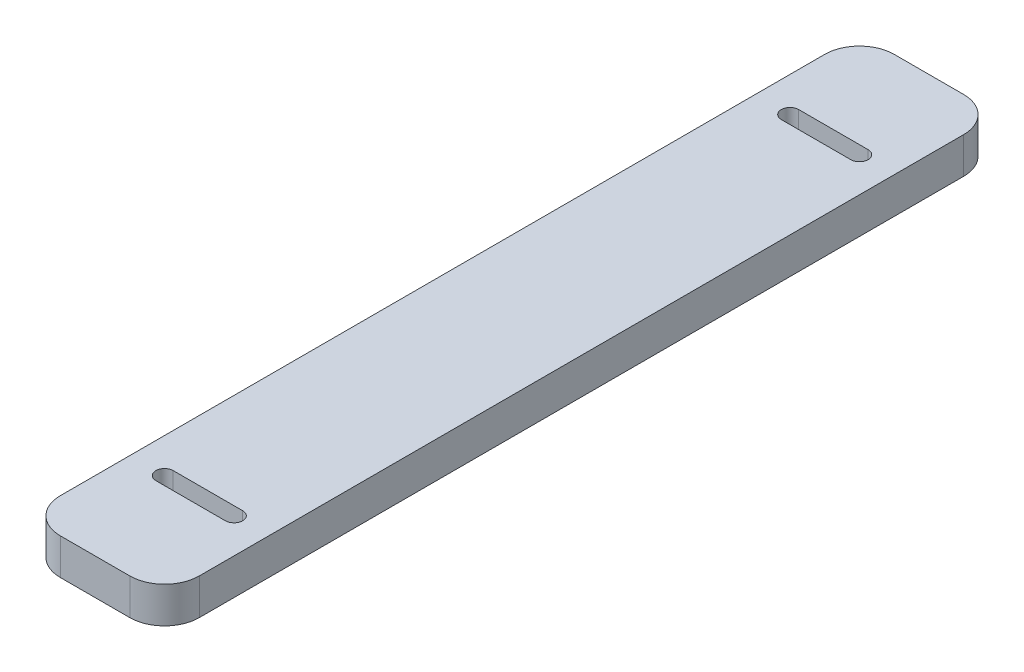
ISO-10303-21;
HEADER;
FILE_DESCRIPTION(('STEP AP214'),'2;1');
FILE_NAME('part.step','',(''),(''),'','','');
FILE_SCHEMA(('AUTOMOTIVE_DESIGN { 1 0 10303 214 1 1 1 1 }'));
ENDSEC;
DATA;
#1=APPLICATION_CONTEXT('core data for automotive mechanical design processes');
#2=APPLICATION_PROTOCOL_DEFINITION('international standard','automotive_design',2000,#1);
#3=PRODUCT_CONTEXT('',#1,'mechanical');
#4=PRODUCT('Part','Part','',(#3));
#5=PRODUCT_RELATED_PRODUCT_CATEGORY('part','',(#4));
#6=PRODUCT_DEFINITION_FORMATION('','',#4);
#7=PRODUCT_DEFINITION_CONTEXT('part definition',#1,'design');
#8=PRODUCT_DEFINITION('design','',#6,#7);
#9=PRODUCT_DEFINITION_SHAPE('','',#8);
#10=(LENGTH_UNIT() NAMED_UNIT(*) SI_UNIT(.MILLI.,.METRE.));
#11=(NAMED_UNIT(*) PLANE_ANGLE_UNIT() SI_UNIT($,.RADIAN.));
#12=(NAMED_UNIT(*) SI_UNIT($,.STERADIAN.) SOLID_ANGLE_UNIT());
#13=UNCERTAINTY_MEASURE_WITH_UNIT(LENGTH_MEASURE(1.E-05),#10,'distance_accuracy_value','');
#14=(GEOMETRIC_REPRESENTATION_CONTEXT(3) GLOBAL_UNCERTAINTY_ASSIGNED_CONTEXT((#13)) GLOBAL_UNIT_ASSIGNED_CONTEXT((#10,
#11,#12)) REPRESENTATION_CONTEXT('',''));
#15=CARTESIAN_POINT('',(0.,0.,0.));
#16=DIRECTION('',(0.,0.,1.));
#17=DIRECTION('',(1.,0.,0.));
#18=AXIS2_PLACEMENT_3D('',#15,#16,#17);
#19=CARTESIAN_POINT('',(-12.7,6.604,-76.2));
#20=DIRECTION('',(1.,0.,0.));
#21=DIRECTION('',(0.,0.,-1.));
#22=AXIS2_PLACEMENT_3D('',#19,#20,#21);
#23=PLANE('',#22);
#24=DIRECTION('',(0.,0.,1.));
#25=VECTOR('',#24,1.);
#26=CARTESIAN_POINT('',(-12.7,0.,-76.2));
#27=LINE('',#26,#25);
#28=CARTESIAN_POINT('',(-12.7,0.,-69.85));
#29=VERTEX_POINT('',#28);
#30=CARTESIAN_POINT('',(-12.7,0.,69.85));
#31=VERTEX_POINT('',#30);
#32=EDGE_CURVE('E217',#29,#31,#27,.T.);
#33=ORIENTED_EDGE('',*,*,#32,.T.);
#34=DIRECTION('',(0.,-1.,0.));
#35=VECTOR('',#34,1.);
#36=CARTESIAN_POINT('',(-12.7,6.604,69.85));
#37=LINE('',#36,#35);
#38=CARTESIAN_POINT('',(-12.7,6.604,69.85));
#39=VERTEX_POINT('',#38);
#40=EDGE_CURVE('E260',#31,#39,#37,.F.);
#41=ORIENTED_EDGE('',*,*,#40,.T.);
#42=DIRECTION('',(0.,0.,1.));
#43=VECTOR('',#42,1.);
#44=CARTESIAN_POINT('',(-12.7,6.604,-76.2));
#45=LINE('',#44,#43);
#46=CARTESIAN_POINT('',(-12.7,6.604,-69.85));
#47=VERTEX_POINT('',#46);
#48=EDGE_CURVE('E224',#47,#39,#45,.T.);
#49=ORIENTED_EDGE('',*,*,#48,.F.);
#50=DIRECTION('',(0.,-1.,0.));
#51=VECTOR('',#50,1.);
#52=CARTESIAN_POINT('',(-12.7,6.604,-69.85));
#53=LINE('',#52,#51);
#54=EDGE_CURVE('E257',#47,#29,#53,.T.);
#55=ORIENTED_EDGE('',*,*,#54,.T.);
#56=EDGE_LOOP('',(#33,#41,#49,#55));
#57=FACE_BOUND('',#56,.T.);
#58=ADVANCED_FACE('F35',(#57),#23,.F.);
#59=CARTESIAN_POINT('',(-12.7,6.604,76.2));
#60=DIRECTION('',(0.,0.,-1.));
#61=DIRECTION('',(-1.,0.,0.));
#62=AXIS2_PLACEMENT_3D('',#59,#60,#61);
#63=PLANE('',#62);
#64=DIRECTION('',(1.,0.,0.));
#65=VECTOR('',#64,1.);
#66=CARTESIAN_POINT('',(-12.7,6.604,76.2));
#67=LINE('',#66,#65);
#68=CARTESIAN_POINT('',(-6.34999999999999,6.604,76.2));
#69=VERTEX_POINT('',#68);
#70=CARTESIAN_POINT('',(6.35000000000001,6.604,76.2));
#71=VERTEX_POINT('',#70);
#72=EDGE_CURVE('E227',#69,#71,#67,.T.);
#73=ORIENTED_EDGE('',*,*,#72,.F.);
#74=DIRECTION('',(0.,-1.,0.));
#75=VECTOR('',#74,1.);
#76=CARTESIAN_POINT('',(-6.34999999999999,6.604,76.2));
#77=LINE('',#76,#75);
#78=CARTESIAN_POINT('',(-6.34999999999999,0.,76.2));
#79=VERTEX_POINT('',#78);
#80=EDGE_CURVE('E246',#69,#79,#77,.T.);
#81=ORIENTED_EDGE('',*,*,#80,.T.);
#82=DIRECTION('',(1.,0.,0.));
#83=VECTOR('',#82,1.);
#84=CARTESIAN_POINT('',(-12.7,0.,76.2));
#85=LINE('',#84,#83);
#86=CARTESIAN_POINT('',(6.35000000000001,0.,76.2));
#87=VERTEX_POINT('',#86);
#88=EDGE_CURVE('E238',#79,#87,#85,.T.);
#89=ORIENTED_EDGE('',*,*,#88,.T.);
#90=DIRECTION('',(0.,-1.,0.));
#91=VECTOR('',#90,1.);
#92=CARTESIAN_POINT('',(6.35000000000001,6.604,76.2));
#93=LINE('',#92,#91);
#94=EDGE_CURVE('E235',#87,#71,#93,.F.);
#95=ORIENTED_EDGE('',*,*,#94,.T.);
#96=EDGE_LOOP('',(#73,#81,#89,#95));
#97=FACE_BOUND('',#96,.T.);
#98=ADVANCED_FACE('F296',(#97),#63,.F.);
#99=CARTESIAN_POINT('',(12.7,6.604,-76.2));
#100=DIRECTION('',(-1.,0.,0.));
#101=DIRECTION('',(0.,0.,1.));
#102=AXIS2_PLACEMENT_3D('',#99,#100,#101);
#103=PLANE('',#102);
#104=DIRECTION('',(0.,0.,-1.));
#105=VECTOR('',#104,1.);
#106=CARTESIAN_POINT('',(12.7,6.604,-76.2));
#107=LINE('',#106,#105);
#108=CARTESIAN_POINT('',(12.7,6.604,69.85));
#109=VERTEX_POINT('',#108);
#110=CARTESIAN_POINT('',(12.7,6.604,-69.85));
#111=VERTEX_POINT('',#110);
#112=EDGE_CURVE('E231',#109,#111,#107,.T.);
#113=ORIENTED_EDGE('',*,*,#112,.F.);
#114=DIRECTION('',(0.,-1.,0.));
#115=VECTOR('',#114,1.);
#116=CARTESIAN_POINT('',(12.7,6.604,69.85));
#117=LINE('',#116,#115);
#118=CARTESIAN_POINT('',(12.7,0.,69.85));
#119=VERTEX_POINT('',#118);
#120=EDGE_CURVE('E271',#109,#119,#117,.T.);
#121=ORIENTED_EDGE('',*,*,#120,.T.);
#122=DIRECTION('',(0.,0.,-1.));
#123=VECTOR('',#122,1.);
#124=CARTESIAN_POINT('',(12.7,0.,-76.2));
#125=LINE('',#124,#123);
#126=CARTESIAN_POINT('',(12.7,0.,-69.85));
#127=VERTEX_POINT('',#126);
#128=EDGE_CURVE('E241',#119,#127,#125,.T.);
#129=ORIENTED_EDGE('',*,*,#128,.T.);
#130=DIRECTION('',(0.,-1.,0.));
#131=VECTOR('',#130,1.);
#132=CARTESIAN_POINT('',(12.7,6.604,-69.85));
#133=LINE('',#132,#131);
#134=EDGE_CURVE('E269',#127,#111,#133,.F.);
#135=ORIENTED_EDGE('',*,*,#134,.T.);
#136=EDGE_LOOP('',(#113,#121,#129,#135));
#137=FACE_BOUND('',#136,.T.);
#138=ADVANCED_FACE('F304',(#137),#103,.F.);
#139=CARTESIAN_POINT('',(-12.7,6.604,-76.2));
#140=DIRECTION('',(0.,0.,1.));
#141=DIRECTION('',(1.,0.,0.));
#142=AXIS2_PLACEMENT_3D('',#139,#140,#141);
#143=PLANE('',#142);
#144=DIRECTION('',(-1.,0.,0.));
#145=VECTOR('',#144,1.);
#146=CARTESIAN_POINT('',(-12.7,0.,-76.2));
#147=LINE('',#146,#145);
#148=CARTESIAN_POINT('',(6.34999999999999,0.,-76.2));
#149=VERTEX_POINT('',#148);
#150=CARTESIAN_POINT('',(-6.35000000000001,0.,-76.2));
#151=VERTEX_POINT('',#150);
#152=EDGE_CURVE('E228',#149,#151,#147,.T.);
#153=ORIENTED_EDGE('',*,*,#152,.T.);
#154=DIRECTION('',(0.,-1.,0.));
#155=VECTOR('',#154,1.);
#156=CARTESIAN_POINT('',(-6.35000000000001,6.604,-76.2));
#157=LINE('',#156,#155);
#158=CARTESIAN_POINT('',(-6.35000000000001,6.604,-76.2));
#159=VERTEX_POINT('',#158);
#160=EDGE_CURVE('E11',#151,#159,#157,.F.);
#161=ORIENTED_EDGE('',*,*,#160,.T.);
#162=DIRECTION('',(-1.,0.,0.));
#163=VECTOR('',#162,1.);
#164=CARTESIAN_POINT('',(-12.7,6.604,-76.2));
#165=LINE('',#164,#163);
#166=CARTESIAN_POINT('',(6.34999999999999,6.604,-76.2));
#167=VERTEX_POINT('',#166);
#168=EDGE_CURVE('E233',#167,#159,#165,.T.);
#169=ORIENTED_EDGE('',*,*,#168,.F.);
#170=DIRECTION('',(0.,-1.,0.));
#171=VECTOR('',#170,1.);
#172=CARTESIAN_POINT('',(6.34999999999999,6.604,-76.2));
#173=LINE('',#172,#171);
#174=EDGE_CURVE('E43',#167,#149,#173,.T.);
#175=ORIENTED_EDGE('',*,*,#174,.T.);
#176=EDGE_LOOP('',(#153,#161,#169,#175));
#177=FACE_BOUND('',#176,.T.);
#178=ADVANCED_FACE('F276',(#177),#143,.F.);
#179=CARTESIAN_POINT('',(0.,6.604,0.));
#180=DIRECTION('',(0.,1.,0.));
#181=DIRECTION('',(0.,0.,1.));
#182=AXIS2_PLACEMENT_3D('',#179,#180,#181);
#183=PLANE('',#182);
#184=CARTESIAN_POINT('',(-6.34999999999999,6.604,57.15));
#185=DIRECTION('',(0.,1.,0.));
#186=DIRECTION('',(0.,0.,1.));
#187=AXIS2_PLACEMENT_3D('',#184,#185,#186);
#188=CIRCLE('',#187,1.5875);
#189=CARTESIAN_POINT('',(-6.34999999999999,6.604,55.5625));
#190=VERTEX_POINT('',#189);
#191=CARTESIAN_POINT('',(-6.34999999999999,6.604,58.7375));
#192=VERTEX_POINT('',#191);
#193=EDGE_CURVE('E155',#190,#192,#188,.T.);
#194=ORIENTED_EDGE('',*,*,#193,.F.);
#195=DIRECTION('',(-1.,0.,0.));
#196=VECTOR('',#195,1.);
#197=CARTESIAN_POINT('',(-6.34999999999999,6.604,55.5625));
#198=LINE('',#197,#196);
#199=CARTESIAN_POINT('',(6.35000000000001,6.604,55.5625));
#200=VERTEX_POINT('',#199);
#201=EDGE_CURVE('E173',#200,#190,#198,.T.);
#202=ORIENTED_EDGE('',*,*,#201,.F.);
#203=CARTESIAN_POINT('',(6.35000000000001,6.604,57.15));
#204=DIRECTION('',(0.,1.,0.));
#205=DIRECTION('',(0.,0.,1.));
#206=AXIS2_PLACEMENT_3D('',#203,#204,#205);
#207=CIRCLE('',#206,1.5875);
#208=CARTESIAN_POINT('',(6.35000000000001,6.604,58.7375));
#209=VERTEX_POINT('',#208);
#210=EDGE_CURVE('E176',#209,#200,#207,.T.);
#211=ORIENTED_EDGE('',*,*,#210,.F.);
#212=DIRECTION('',(1.,0.,0.));
#213=VECTOR('',#212,1.);
#214=CARTESIAN_POINT('',(-6.34999999999999,6.604,58.7375));
#215=LINE('',#214,#213);
#216=EDGE_CURVE('E182',#192,#209,#215,.T.);
#217=ORIENTED_EDGE('',*,*,#216,.F.);
#218=EDGE_LOOP('',(#194,#202,#211,#217));
#219=FACE_BOUND('',#218,.T.);
#220=CARTESIAN_POINT('',(-6.35,6.604,-57.15));
#221=DIRECTION('',(0.,1.,0.));
#222=DIRECTION('',(0.,0.,1.));
#223=AXIS2_PLACEMENT_3D('',#220,#221,#222);
#224=CIRCLE('',#223,1.5875);
#225=CARTESIAN_POINT('',(-6.35,6.604,-58.7375));
#226=VERTEX_POINT('',#225);
#227=CARTESIAN_POINT('',(-6.35,6.604,-55.5625));
#228=VERTEX_POINT('',#227);
#229=EDGE_CURVE('E188',#226,#228,#224,.T.);
#230=ORIENTED_EDGE('',*,*,#229,.F.);
#231=DIRECTION('',(-1.,0.,0.));
#232=VECTOR('',#231,1.);
#233=CARTESIAN_POINT('',(-6.35,6.604,-58.7375));
#234=LINE('',#233,#232);
#235=CARTESIAN_POINT('',(6.35,6.604,-58.7375));
#236=VERTEX_POINT('',#235);
#237=EDGE_CURVE('E196',#236,#226,#234,.T.);
#238=ORIENTED_EDGE('',*,*,#237,.F.);
#239=CARTESIAN_POINT('',(6.35,6.604,-57.15));
#240=DIRECTION('',(0.,1.,0.));
#241=DIRECTION('',(0.,0.,1.));
#242=AXIS2_PLACEMENT_3D('',#239,#240,#241);
#243=CIRCLE('',#242,1.5875);
#244=CARTESIAN_POINT('',(6.35,6.604,-55.5625));
#245=VERTEX_POINT('',#244);
#246=EDGE_CURVE('E210',#245,#236,#243,.T.);
#247=ORIENTED_EDGE('',*,*,#246,.F.);
#248=DIRECTION('',(1.,0.,0.));
#249=VECTOR('',#248,1.);
#250=CARTESIAN_POINT('',(-6.35,6.604,-55.5625));
#251=LINE('',#250,#249);
#252=EDGE_CURVE('E207',#228,#245,#251,.T.);
#253=ORIENTED_EDGE('',*,*,#252,.F.);
#254=EDGE_LOOP('',(#230,#238,#247,#253));
#255=FACE_BOUND('',#254,.T.);
#256=ORIENTED_EDGE('',*,*,#48,.T.);
#257=CARTESIAN_POINT('',(-6.34999999999999,6.604,69.85));
#258=DIRECTION('',(0.,1.,0.));
#259=DIRECTION('',(0.,0.,1.));
#260=AXIS2_PLACEMENT_3D('',#257,#258,#259);
#261=CIRCLE('',#260,6.35);
#262=EDGE_CURVE('E267',#39,#69,#261,.T.);
#263=ORIENTED_EDGE('',*,*,#262,.T.);
#264=ORIENTED_EDGE('',*,*,#72,.T.);
#265=CARTESIAN_POINT('',(6.35000000000001,6.604,69.85));
#266=DIRECTION('',(0.,1.,0.));
#267=DIRECTION('',(0.,0.,1.));
#268=AXIS2_PLACEMENT_3D('',#265,#266,#267);
#269=CIRCLE('',#268,6.35);
#270=EDGE_CURVE('E265',#71,#109,#269,.T.);
#271=ORIENTED_EDGE('',*,*,#270,.T.);
#272=ORIENTED_EDGE('',*,*,#112,.T.);
#273=CARTESIAN_POINT('',(6.34999999999999,6.604,-69.85));
#274=DIRECTION('',(0.,1.,0.));
#275=DIRECTION('',(0.,0.,1.));
#276=AXIS2_PLACEMENT_3D('',#273,#274,#275);
#277=CIRCLE('',#276,6.35);
#278=EDGE_CURVE('E55',#111,#167,#277,.T.);
#279=ORIENTED_EDGE('',*,*,#278,.T.);
#280=ORIENTED_EDGE('',*,*,#168,.T.);
#281=CARTESIAN_POINT('',(-6.35000000000001,6.604,-69.85));
#282=DIRECTION('',(0.,1.,0.));
#283=DIRECTION('',(0.,0.,1.));
#284=AXIS2_PLACEMENT_3D('',#281,#282,#283);
#285=CIRCLE('',#284,6.35);
#286=EDGE_CURVE('E263',#159,#47,#285,.T.);
#287=ORIENTED_EDGE('',*,*,#286,.T.);
#288=EDGE_LOOP('',(#256,#263,#264,#271,#272,#279,#280,#287));
#289=FACE_BOUND('',#288,.T.);
#290=ADVANCED_FACE('F290',(#219,#255,#289),#183,.T.);
#291=CARTESIAN_POINT('',(0.,0.,0.));
#292=DIRECTION('',(0.,1.,0.));
#293=DIRECTION('',(0.,0.,1.));
#294=AXIS2_PLACEMENT_3D('',#291,#292,#293);
#295=PLANE('',#294);
#296=DIRECTION('',(-1.,0.,0.));
#297=VECTOR('',#296,1.);
#298=CARTESIAN_POINT('',(-6.34999999999999,0.,55.5625));
#299=LINE('',#298,#297);
#300=CARTESIAN_POINT('',(6.35000000000001,0.,55.5625));
#301=VERTEX_POINT('',#300);
#302=CARTESIAN_POINT('',(-6.34999999999999,0.,55.5625));
#303=VERTEX_POINT('',#302);
#304=EDGE_CURVE('E160',#301,#303,#299,.T.);
#305=ORIENTED_EDGE('',*,*,#304,.T.);
#306=CARTESIAN_POINT('',(-6.34999999999999,0.,57.15));
#307=DIRECTION('',(0.,1.,0.));
#308=DIRECTION('',(0.,0.,1.));
#309=AXIS2_PLACEMENT_3D('',#306,#307,#308);
#310=CIRCLE('',#309,1.5875);
#311=CARTESIAN_POINT('',(-6.34999999999999,0.,58.7375));
#312=VERTEX_POINT('',#311);
#313=EDGE_CURVE('E152',#303,#312,#310,.T.);
#314=ORIENTED_EDGE('',*,*,#313,.T.);
#315=DIRECTION('',(1.,0.,0.));
#316=VECTOR('',#315,1.);
#317=CARTESIAN_POINT('',(-6.34999999999999,0.,58.7375));
#318=LINE('',#317,#316);
#319=CARTESIAN_POINT('',(6.35000000000001,0.,58.7375));
#320=VERTEX_POINT('',#319);
#321=EDGE_CURVE('E164',#312,#320,#318,.T.);
#322=ORIENTED_EDGE('',*,*,#321,.T.);
#323=CARTESIAN_POINT('',(6.35000000000001,0.,57.15));
#324=DIRECTION('',(0.,1.,0.));
#325=DIRECTION('',(0.,0.,1.));
#326=AXIS2_PLACEMENT_3D('',#323,#324,#325);
#327=CIRCLE('',#326,1.5875);
#328=EDGE_CURVE('E168',#320,#301,#327,.T.);
#329=ORIENTED_EDGE('',*,*,#328,.T.);
#330=EDGE_LOOP('',(#305,#314,#322,#329));
#331=FACE_BOUND('',#330,.T.);
#332=DIRECTION('',(-1.,0.,0.));
#333=VECTOR('',#332,1.);
#334=CARTESIAN_POINT('',(-6.35,0.,-58.7375));
#335=LINE('',#334,#333);
#336=CARTESIAN_POINT('',(6.35,0.,-58.7375));
#337=VERTEX_POINT('',#336);
#338=CARTESIAN_POINT('',(-6.35,0.,-58.7375));
#339=VERTEX_POINT('',#338);
#340=EDGE_CURVE('E202',#337,#339,#335,.T.);
#341=ORIENTED_EDGE('',*,*,#340,.T.);
#342=CARTESIAN_POINT('',(-6.35,0.,-57.15));
#343=DIRECTION('',(0.,1.,0.));
#344=DIRECTION('',(0.,0.,1.));
#345=AXIS2_PLACEMENT_3D('',#342,#343,#344);
#346=CIRCLE('',#345,1.5875);
#347=CARTESIAN_POINT('',(-6.35,0.,-55.5625));
#348=VERTEX_POINT('',#347);
#349=EDGE_CURVE('E192',#339,#348,#346,.T.);
#350=ORIENTED_EDGE('',*,*,#349,.T.);
#351=DIRECTION('',(1.,0.,0.));
#352=VECTOR('',#351,1.);
#353=CARTESIAN_POINT('',(-6.35,0.,-55.5625));
#354=LINE('',#353,#352);
#355=CARTESIAN_POINT('',(6.35,0.,-55.5625));
#356=VERTEX_POINT('',#355);
#357=EDGE_CURVE('E195',#348,#356,#354,.T.);
#358=ORIENTED_EDGE('',*,*,#357,.T.);
#359=CARTESIAN_POINT('',(6.35,0.,-57.15));
#360=DIRECTION('',(0.,1.,0.));
#361=DIRECTION('',(0.,0.,1.));
#362=AXIS2_PLACEMENT_3D('',#359,#360,#361);
#363=CIRCLE('',#362,1.5875);
#364=EDGE_CURVE('E199',#356,#337,#363,.T.);
#365=ORIENTED_EDGE('',*,*,#364,.T.);
#366=EDGE_LOOP('',(#341,#350,#358,#365));
#367=FACE_BOUND('',#366,.T.);
#368=ORIENTED_EDGE('',*,*,#88,.F.);
#369=CARTESIAN_POINT('',(-6.34999999999999,0.,69.85));
#370=DIRECTION('',(0.,1.,0.));
#371=DIRECTION('',(0.,0.,1.));
#372=AXIS2_PLACEMENT_3D('',#369,#370,#371);
#373=CIRCLE('',#372,6.35);
#374=EDGE_CURVE('E255',#79,#31,#373,.F.);
#375=ORIENTED_EDGE('',*,*,#374,.T.);
#376=ORIENTED_EDGE('',*,*,#32,.F.);
#377=CARTESIAN_POINT('',(-6.35000000000001,0.,-69.85));
#378=DIRECTION('',(0.,1.,0.));
#379=DIRECTION('',(0.,0.,1.));
#380=AXIS2_PLACEMENT_3D('',#377,#378,#379);
#381=CIRCLE('',#380,6.35);
#382=EDGE_CURVE('E251',#29,#151,#381,.F.);
#383=ORIENTED_EDGE('',*,*,#382,.T.);
#384=ORIENTED_EDGE('',*,*,#152,.F.);
#385=CARTESIAN_POINT('',(6.34999999999999,0.,-69.85));
#386=DIRECTION('',(0.,1.,0.));
#387=DIRECTION('',(0.,0.,1.));
#388=AXIS2_PLACEMENT_3D('',#385,#386,#387);
#389=CIRCLE('',#388,6.35);
#390=EDGE_CURVE('E249',#149,#127,#389,.F.);
#391=ORIENTED_EDGE('',*,*,#390,.T.);
#392=ORIENTED_EDGE('',*,*,#128,.F.);
#393=CARTESIAN_POINT('',(6.35000000000001,0.,69.85));
#394=DIRECTION('',(0.,1.,0.));
#395=DIRECTION('',(0.,0.,1.));
#396=AXIS2_PLACEMENT_3D('',#393,#394,#395);
#397=CIRCLE('',#396,6.35);
#398=EDGE_CURVE('E253',#119,#87,#397,.F.);
#399=ORIENTED_EDGE('',*,*,#398,.T.);
#400=EDGE_LOOP('',(#368,#375,#376,#383,#384,#391,#392,#399));
#401=FACE_BOUND('',#400,.T.);
#402=ADVANCED_FACE('F170',(#331,#367,#401),#295,.F.);
#403=CARTESIAN_POINT('',(-6.35,0.,-57.15));
#404=DIRECTION('',(0.,1.,0.));
#405=DIRECTION('',(0.,0.,1.));
#406=AXIS2_PLACEMENT_3D('',#403,#404,#405);
#407=CYLINDRICAL_SURFACE('',#406,1.5875);
#408=ORIENTED_EDGE('',*,*,#229,.T.);
#409=DIRECTION('',(0.,1.,0.));
#410=VECTOR('',#409,1.);
#411=CARTESIAN_POINT('',(-6.35,0.,-55.5625));
#412=LINE('',#411,#410);
#413=EDGE_CURVE('E205',#348,#228,#412,.T.);
#414=ORIENTED_EDGE('',*,*,#413,.F.);
#415=ORIENTED_EDGE('',*,*,#349,.F.);
#416=DIRECTION('',(0.,1.,0.));
#417=VECTOR('',#416,1.);
#418=CARTESIAN_POINT('',(-6.35,0.,-58.7375));
#419=LINE('',#418,#417);
#420=EDGE_CURVE('E215',#339,#226,#419,.T.);
#421=ORIENTED_EDGE('',*,*,#420,.T.);
#422=EDGE_LOOP('',(#408,#414,#415,#421));
#423=FACE_BOUND('',#422,.T.);
#424=ADVANCED_FACE('F401',(#423),#407,.F.);
#425=CARTESIAN_POINT('',(-6.35,0.,-58.7375));
#426=DIRECTION('',(0.,0.,-1.));
#427=DIRECTION('',(-1.,0.,0.));
#428=AXIS2_PLACEMENT_3D('',#425,#426,#427);
#429=PLANE('',#428);
#430=ORIENTED_EDGE('',*,*,#237,.T.);
#431=ORIENTED_EDGE('',*,*,#420,.F.);
#432=ORIENTED_EDGE('',*,*,#340,.F.);
#433=DIRECTION('',(0.,1.,0.));
#434=VECTOR('',#433,1.);
#435=CARTESIAN_POINT('',(6.35,0.,-58.7375));
#436=LINE('',#435,#434);
#437=EDGE_CURVE('E218',#337,#236,#436,.T.);
#438=ORIENTED_EDGE('',*,*,#437,.T.);
#439=EDGE_LOOP('',(#430,#431,#432,#438));
#440=FACE_BOUND('',#439,.T.);
#441=ADVANCED_FACE('F392',(#440),#429,.F.);
#442=CARTESIAN_POINT('',(6.35,0.,-57.15));
#443=DIRECTION('',(0.,1.,0.));
#444=DIRECTION('',(0.,0.,1.));
#445=AXIS2_PLACEMENT_3D('',#442,#443,#444);
#446=CYLINDRICAL_SURFACE('',#445,1.5875);
#447=ORIENTED_EDGE('',*,*,#246,.T.);
#448=ORIENTED_EDGE('',*,*,#437,.F.);
#449=ORIENTED_EDGE('',*,*,#364,.F.);
#450=DIRECTION('',(0.,1.,0.));
#451=VECTOR('',#450,1.);
#452=CARTESIAN_POINT('',(6.35,0.,-55.5625));
#453=LINE('',#452,#451);
#454=EDGE_CURVE('E220',#356,#245,#453,.T.);
#455=ORIENTED_EDGE('',*,*,#454,.T.);
#456=EDGE_LOOP('',(#447,#448,#449,#455));
#457=FACE_BOUND('',#456,.T.);
#458=ADVANCED_FACE('F383',(#457),#446,.F.);
#459=CARTESIAN_POINT('',(-6.35,0.,-55.5625));
#460=DIRECTION('',(0.,0.,1.));
#461=DIRECTION('',(1.,0.,0.));
#462=AXIS2_PLACEMENT_3D('',#459,#460,#461);
#463=PLANE('',#462);
#464=ORIENTED_EDGE('',*,*,#252,.T.);
#465=ORIENTED_EDGE('',*,*,#454,.F.);
#466=ORIENTED_EDGE('',*,*,#357,.F.);
#467=ORIENTED_EDGE('',*,*,#413,.T.);
#468=EDGE_LOOP('',(#464,#465,#466,#467));
#469=FACE_BOUND('',#468,.T.);
#470=ADVANCED_FACE('F375',(#469),#463,.F.);
#471=CARTESIAN_POINT('',(-6.34999999999999,0.,57.15));
#472=DIRECTION('',(0.,1.,0.));
#473=DIRECTION('',(0.,0.,1.));
#474=AXIS2_PLACEMENT_3D('',#471,#472,#473);
#475=CYLINDRICAL_SURFACE('',#474,1.5875);
#476=ORIENTED_EDGE('',*,*,#193,.T.);
#477=DIRECTION('',(0.,1.,0.));
#478=VECTOR('',#477,1.);
#479=CARTESIAN_POINT('',(-6.34999999999999,0.,58.7375));
#480=LINE('',#479,#478);
#481=EDGE_CURVE('E148',#312,#192,#480,.T.);
#482=ORIENTED_EDGE('',*,*,#481,.F.);
#483=ORIENTED_EDGE('',*,*,#313,.F.);
#484=DIRECTION('',(0.,1.,0.));
#485=VECTOR('',#484,1.);
#486=CARTESIAN_POINT('',(-6.34999999999999,0.,55.5625));
#487=LINE('',#486,#485);
#488=EDGE_CURVE('E186',#303,#190,#487,.T.);
#489=ORIENTED_EDGE('',*,*,#488,.T.);
#490=EDGE_LOOP('',(#476,#482,#483,#489));
#491=FACE_BOUND('',#490,.T.);
#492=ADVANCED_FACE('F150',(#491),#475,.F.);
#493=CARTESIAN_POINT('',(-6.34999999999999,0.,55.5625));
#494=DIRECTION('',(0.,0.,-1.));
#495=DIRECTION('',(-1.,0.,0.));
#496=AXIS2_PLACEMENT_3D('',#493,#494,#495);
#497=PLANE('',#496);
#498=ORIENTED_EDGE('',*,*,#201,.T.);
#499=ORIENTED_EDGE('',*,*,#488,.F.);
#500=ORIENTED_EDGE('',*,*,#304,.F.);
#501=DIRECTION('',(0.,1.,0.));
#502=VECTOR('',#501,1.);
#503=CARTESIAN_POINT('',(6.35000000000001,0.,55.5625));
#504=LINE('',#503,#502);
#505=EDGE_CURVE('E189',#301,#200,#504,.T.);
#506=ORIENTED_EDGE('',*,*,#505,.T.);
#507=EDGE_LOOP('',(#498,#499,#500,#506));
#508=FACE_BOUND('',#507,.T.);
#509=ADVANCED_FACE('F358',(#508),#497,.F.);
#510=CARTESIAN_POINT('',(6.35000000000001,0.,57.15));
#511=DIRECTION('',(0.,1.,0.));
#512=DIRECTION('',(0.,0.,1.));
#513=AXIS2_PLACEMENT_3D('',#510,#511,#512);
#514=CYLINDRICAL_SURFACE('',#513,1.5875);
#515=ORIENTED_EDGE('',*,*,#210,.T.);
#516=ORIENTED_EDGE('',*,*,#505,.F.);
#517=ORIENTED_EDGE('',*,*,#328,.F.);
#518=DIRECTION('',(0.,1.,0.));
#519=VECTOR('',#518,1.);
#520=CARTESIAN_POINT('',(6.35000000000001,0.,58.7375));
#521=LINE('',#520,#519);
#522=EDGE_CURVE('E159',#320,#209,#521,.T.);
#523=ORIENTED_EDGE('',*,*,#522,.T.);
#524=EDGE_LOOP('',(#515,#516,#517,#523));
#525=FACE_BOUND('',#524,.T.);
#526=ADVANCED_FACE('F350',(#525),#514,.F.);
#527=CARTESIAN_POINT('',(-6.34999999999999,0.,58.7375));
#528=DIRECTION('',(0.,0.,1.));
#529=DIRECTION('',(1.,0.,0.));
#530=AXIS2_PLACEMENT_3D('',#527,#528,#529);
#531=PLANE('',#530);
#532=ORIENTED_EDGE('',*,*,#216,.T.);
#533=ORIENTED_EDGE('',*,*,#522,.F.);
#534=ORIENTED_EDGE('',*,*,#321,.F.);
#535=ORIENTED_EDGE('',*,*,#481,.T.);
#536=EDGE_LOOP('',(#532,#533,#534,#535));
#537=FACE_BOUND('',#536,.T.);
#538=ADVANCED_FACE('F165',(#537),#531,.F.);
#539=CARTESIAN_POINT('',(-6.34999999999999,6.604,69.85));
#540=DIRECTION('',(0.,-1.,0.));
#541=DIRECTION('',(0.,0.,-1.));
#542=AXIS2_PLACEMENT_3D('',#539,#540,#541);
#543=CYLINDRICAL_SURFACE('',#542,6.35);
#544=ORIENTED_EDGE('',*,*,#262,.F.);
#545=ORIENTED_EDGE('',*,*,#40,.F.);
#546=ORIENTED_EDGE('',*,*,#374,.F.);
#547=ORIENTED_EDGE('',*,*,#80,.F.);
#548=EDGE_LOOP('',(#544,#545,#546,#547));
#549=FACE_BOUND('',#548,.T.);
#550=ADVANCED_FACE('F294',(#549),#543,.T.);
#551=CARTESIAN_POINT('',(6.35000000000001,6.604,69.85));
#552=DIRECTION('',(0.,-1.,0.));
#553=DIRECTION('',(0.,0.,-1.));
#554=AXIS2_PLACEMENT_3D('',#551,#552,#553);
#555=CYLINDRICAL_SURFACE('',#554,6.35);
#556=ORIENTED_EDGE('',*,*,#270,.F.);
#557=ORIENTED_EDGE('',*,*,#94,.F.);
#558=ORIENTED_EDGE('',*,*,#398,.F.);
#559=ORIENTED_EDGE('',*,*,#120,.F.);
#560=EDGE_LOOP('',(#556,#557,#558,#559));
#561=FACE_BOUND('',#560,.T.);
#562=ADVANCED_FACE('F301',(#561),#555,.T.);
#563=CARTESIAN_POINT('',(-6.35000000000001,6.604,-69.85));
#564=DIRECTION('',(0.,-1.,0.));
#565=DIRECTION('',(0.,0.,-1.));
#566=AXIS2_PLACEMENT_3D('',#563,#564,#565);
#567=CYLINDRICAL_SURFACE('',#566,6.35);
#568=ORIENTED_EDGE('',*,*,#286,.F.);
#569=ORIENTED_EDGE('',*,*,#160,.F.);
#570=ORIENTED_EDGE('',*,*,#382,.F.);
#571=ORIENTED_EDGE('',*,*,#54,.F.);
#572=EDGE_LOOP('',(#568,#569,#570,#571));
#573=FACE_BOUND('',#572,.T.);
#574=ADVANCED_FACE('F285',(#573),#567,.T.);
#575=CARTESIAN_POINT('',(6.34999999999999,6.604,-69.85));
#576=DIRECTION('',(0.,-1.,0.));
#577=DIRECTION('',(0.,0.,-1.));
#578=AXIS2_PLACEMENT_3D('',#575,#576,#577);
#579=CYLINDRICAL_SURFACE('',#578,6.35);
#580=ORIENTED_EDGE('',*,*,#278,.F.);
#581=ORIENTED_EDGE('',*,*,#134,.F.);
#582=ORIENTED_EDGE('',*,*,#390,.F.);
#583=ORIENTED_EDGE('',*,*,#174,.F.);
#584=EDGE_LOOP('',(#580,#581,#582,#583));
#585=FACE_BOUND('',#584,.T.);
#586=ADVANCED_FACE('F37',(#585),#579,.T.);
#587=CLOSED_SHELL('',(#58,#98,#138,#178,#290,#402,#424,#441,#458,#470,#492,#509,#526,#538,#550,
#562,#574,#586));
#588=MANIFOLD_SOLID_BREP('B2',#587);
#589=ADVANCED_BREP_SHAPE_REPRESENTATION('',(#18,#588),#14);
#590=SHAPE_DEFINITION_REPRESENTATION(#9,#589);
ENDSEC;
END-ISO-10303-21;
